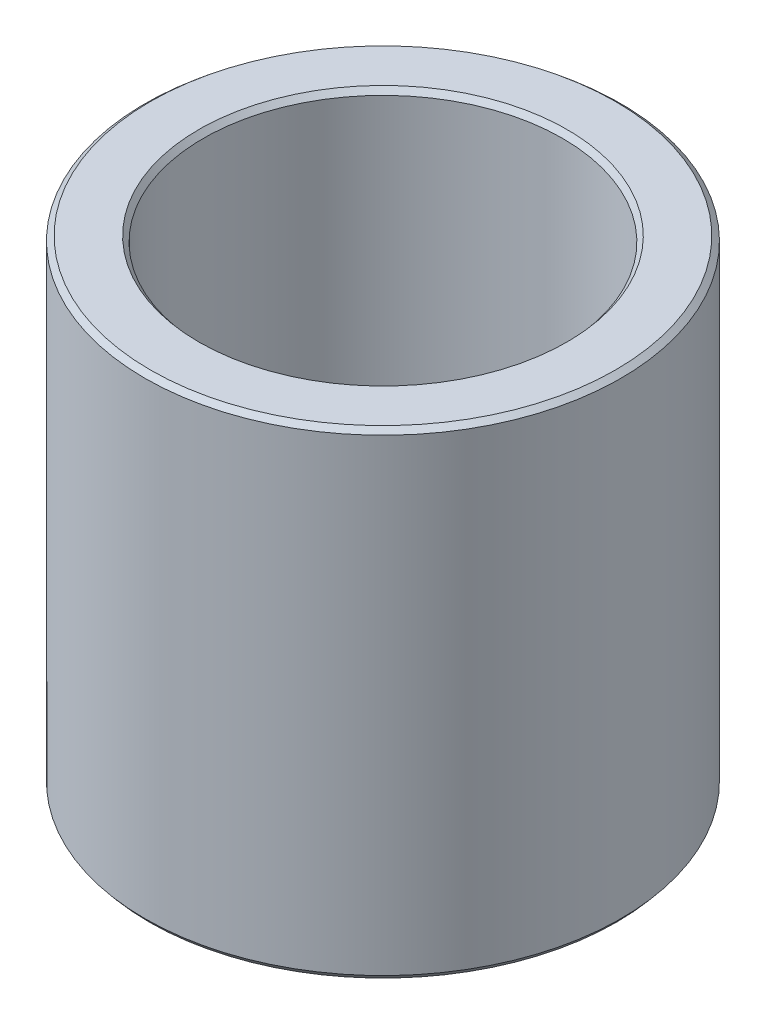
ISO-10303-21;
HEADER;
FILE_DESCRIPTION(('STEP AP214'),'2;1');
FILE_NAME('part.step','',(''),(''),'','','');
FILE_SCHEMA(('AUTOMOTIVE_DESIGN { 1 0 10303 214 1 1 1 1 }'));
ENDSEC;
DATA;
#1=APPLICATION_CONTEXT('core data for automotive mechanical design processes');
#2=APPLICATION_PROTOCOL_DEFINITION('international standard','automotive_design',2000,#1);
#3=PRODUCT_CONTEXT('',#1,'mechanical');
#4=PRODUCT('Part','Part','',(#3));
#5=PRODUCT_RELATED_PRODUCT_CATEGORY('part','',(#4));
#6=PRODUCT_DEFINITION_FORMATION('','',#4);
#7=PRODUCT_DEFINITION_CONTEXT('part definition',#1,'design');
#8=PRODUCT_DEFINITION('design','',#6,#7);
#9=PRODUCT_DEFINITION_SHAPE('','',#8);
#10=(LENGTH_UNIT() NAMED_UNIT(*) SI_UNIT(.MILLI.,.METRE.));
#11=(NAMED_UNIT(*) PLANE_ANGLE_UNIT() SI_UNIT($,.RADIAN.));
#12=(NAMED_UNIT(*) SI_UNIT($,.STERADIAN.) SOLID_ANGLE_UNIT());
#13=UNCERTAINTY_MEASURE_WITH_UNIT(LENGTH_MEASURE(1.E-05),#10,'distance_accuracy_value','');
#14=(GEOMETRIC_REPRESENTATION_CONTEXT(3) GLOBAL_UNCERTAINTY_ASSIGNED_CONTEXT((#13)) GLOBAL_UNIT_ASSIGNED_CONTEXT((#10,
#11,#12)) REPRESENTATION_CONTEXT('',''));
#15=CARTESIAN_POINT('',(0.,0.,0.));
#16=DIRECTION('',(0.,0.,1.));
#17=DIRECTION('',(1.,0.,0.));
#18=AXIS2_PLACEMENT_3D('',#15,#16,#17);
#19=CARTESIAN_POINT('',(0.,55.2294037651439,0.));
#20=DIRECTION('',(0.,-1.,0.));
#21=DIRECTION('',(0.,0.,-1.));
#22=AXIS2_PLACEMENT_3D('',#19,#20,#21);
#23=CYLINDRICAL_SURFACE('',#22,27.5);
#24=CARTESIAN_POINT('',(0.,0.62385524782143,0.));
#25=DIRECTION('',(0.,1.,0.));
#26=DIRECTION('',(0.,0.,1.));
#27=AXIS2_PLACEMENT_3D('',#24,#25,#26);
#28=CIRCLE('',#27,27.5);
#29=CARTESIAN_POINT('',(0.,0.62385524782143,27.5));
#30=VERTEX_POINT('',#29);
#31=EDGE_CURVE('E10',#30,#30,#28,.T.);
#32=ORIENTED_EDGE('',*,*,#31,.T.);
#33=EDGE_LOOP('',(#32));
#34=FACE_BOUND('',#33,.T.);
#35=CARTESIAN_POINT('',(0.,54.7062500959509,0.));
#36=DIRECTION('',(0.,1.,0.));
#37=DIRECTION('',(0.,0.,1.));
#38=AXIS2_PLACEMENT_3D('',#35,#36,#37);
#39=CIRCLE('',#38,27.5);
#40=CARTESIAN_POINT('',(0.,54.7062500959509,27.5));
#41=VERTEX_POINT('',#40);
#42=EDGE_CURVE('E50',#41,#41,#39,.F.);
#43=ORIENTED_EDGE('',*,*,#42,.T.);
#44=EDGE_LOOP('',(#43));
#45=FACE_BOUND('',#44,.T.);
#46=ADVANCED_FACE('F39',(#34,#45),#23,.T.);
#47=CARTESIAN_POINT('',(0.,55.2294037651439,0.));
#48=DIRECTION('',(0.,1.,0.));
#49=DIRECTION('',(0.,0.,1.));
#50=AXIS2_PLACEMENT_3D('',#47,#48,#49);
#51=PLANE('',#50);
#52=CARTESIAN_POINT('',(0.,55.2294037651439,0.));
#53=DIRECTION('',(0.,1.,0.));
#54=DIRECTION('',(0.,0.,1.));
#55=AXIS2_PLACEMENT_3D('',#52,#53,#54);
#56=CIRCLE('',#55,21.2773775607063);
#57=CARTESIAN_POINT('',(0.,55.2294037651439,21.2773775607063));
#58=VERTEX_POINT('',#57);
#59=EDGE_CURVE('E58',#58,#58,#56,.F.);
#60=ORIENTED_EDGE('',*,*,#59,.T.);
#61=EDGE_LOOP('',(#60));
#62=FACE_BOUND('',#61,.T.);
#63=CARTESIAN_POINT('',(0.,55.2294037651439,0.));
#64=DIRECTION('',(0.,1.,0.));
#65=DIRECTION('',(0.,0.,1.));
#66=AXIS2_PLACEMENT_3D('',#63,#64,#65);
#67=CIRCLE('',#66,26.8761447521786);
#68=CARTESIAN_POINT('',(0.,55.2294037651439,26.8761447521786));
#69=VERTEX_POINT('',#68);
#70=EDGE_CURVE('E61',#69,#69,#67,.T.);
#71=ORIENTED_EDGE('',*,*,#70,.T.);
#72=EDGE_LOOP('',(#71));
#73=FACE_BOUND('',#72,.T.);
#74=ADVANCED_FACE('F88',(#62,#73),#51,.T.);
#75=CARTESIAN_POINT('',(0.,0.,0.));
#76=DIRECTION('',(0.,1.,0.));
#77=DIRECTION('',(0.,0.,1.));
#78=AXIS2_PLACEMENT_3D('',#75,#76,#77);
#79=PLANE('',#78);
#80=CARTESIAN_POINT('',(0.,0.,0.));
#81=DIRECTION('',(0.,1.,0.));
#82=DIRECTION('',(0.,0.,1.));
#83=AXIS2_PLACEMENT_3D('',#80,#81,#82);
#84=CIRCLE('',#83,21.3780791393347);
#85=CARTESIAN_POINT('',(0.,0.,21.3780791393347));
#86=VERTEX_POINT('',#85);
#87=EDGE_CURVE('E51',#86,#86,#84,.T.);
#88=ORIENTED_EDGE('',*,*,#87,.T.);
#89=EDGE_LOOP('',(#88));
#90=FACE_BOUND('',#89,.T.);
#91=CARTESIAN_POINT('',(0.,0.,0.));
#92=DIRECTION('',(0.,1.,0.));
#93=DIRECTION('',(0.,0.,1.));
#94=AXIS2_PLACEMENT_3D('',#91,#92,#93);
#95=CIRCLE('',#94,26.976846330807);
#96=CARTESIAN_POINT('',(0.,0.,26.976846330807));
#97=VERTEX_POINT('',#96);
#98=EDGE_CURVE('E54',#97,#97,#95,.F.);
#99=ORIENTED_EDGE('',*,*,#98,.T.);
#100=EDGE_LOOP('',(#99));
#101=FACE_BOUND('',#100,.T.);
#102=ADVANCED_FACE('F83',(#90,#101),#79,.F.);
#103=CARTESIAN_POINT('',(0.,55.2294037651439,0.));
#104=DIRECTION('',(0.,-1.,0.));
#105=DIRECTION('',(0.,0.,-1.));
#106=AXIS2_PLACEMENT_3D('',#103,#104,#105);
#107=CYLINDRICAL_SURFACE('',#106,20.7542238915133);
#108=CARTESIAN_POINT('',(0.,54.6055485173224,0.));
#109=DIRECTION('',(0.,1.,0.));
#110=DIRECTION('',(0.,0.,1.));
#111=AXIS2_PLACEMENT_3D('',#108,#109,#110);
#112=CIRCLE('',#111,20.7542238915133);
#113=CARTESIAN_POINT('',(0.,54.6055485173224,20.7542238915133));
#114=VERTEX_POINT('',#113);
#115=EDGE_CURVE('E67',#114,#114,#112,.T.);
#116=ORIENTED_EDGE('',*,*,#115,.T.);
#117=EDGE_LOOP('',(#116));
#118=FACE_BOUND('',#117,.T.);
#119=CARTESIAN_POINT('',(0.,0.523153669192984,0.));
#120=DIRECTION('',(0.,1.,0.));
#121=DIRECTION('',(0.,0.,1.));
#122=AXIS2_PLACEMENT_3D('',#119,#120,#121);
#123=CIRCLE('',#122,20.7542238915133);
#124=CARTESIAN_POINT('',(0.,0.523153669192984,20.7542238915133));
#125=VERTEX_POINT('',#124);
#126=EDGE_CURVE('E69',#125,#125,#123,.F.);
#127=ORIENTED_EDGE('',*,*,#126,.T.);
#128=EDGE_LOOP('',(#127));
#129=FACE_BOUND('',#128,.T.);
#130=ADVANCED_FACE('F71',(#118,#129),#107,.F.);
#131=CARTESIAN_POINT('',(0.,54.6055485173224,0.));
#132=DIRECTION('',(0.,1.,0.));
#133=DIRECTION('',(0.,0.,1.));
#134=AXIS2_PLACEMENT_3D('',#131,#132,#133);
#135=CONICAL_SURFACE('',#134,20.7542238915133,0.697827759293043);
#136=ORIENTED_EDGE('',*,*,#59,.F.);
#137=EDGE_LOOP('',(#136));
#138=FACE_BOUND('',#137,.T.);
#139=ORIENTED_EDGE('',*,*,#115,.F.);
#140=EDGE_LOOP('',(#139));
#141=FACE_BOUND('',#140,.T.);
#142=ADVANCED_FACE('F77',(#138,#141),#135,.F.);
#143=CARTESIAN_POINT('',(0.,0.,0.));
#144=DIRECTION('',(0.,-1.,0.));
#145=DIRECTION('',(0.,0.,-1.));
#146=AXIS2_PLACEMENT_3D('',#143,#144,#145);
#147=CONICAL_SURFACE('',#146,21.3780791393347,0.872968567501854);
#148=ORIENTED_EDGE('',*,*,#126,.F.);
#149=EDGE_LOOP('',(#148));
#150=FACE_BOUND('',#149,.T.);
#151=ORIENTED_EDGE('',*,*,#87,.F.);
#152=EDGE_LOOP('',(#151));
#153=FACE_BOUND('',#152,.T.);
#154=ADVANCED_FACE('F73',(#150,#153),#147,.F.);
#155=CARTESIAN_POINT('',(0.,0.62385524782143,0.));
#156=DIRECTION('',(0.,1.,0.));
#157=DIRECTION('',(0.,0.,1.));
#158=AXIS2_PLACEMENT_3D('',#155,#156,#157);
#159=CONICAL_SURFACE('',#158,27.5,0.69782775929304);
#160=CARTESIAN_POINT('',(0.,0.,26.976846330807));
#161=CARTESIAN_POINT('',(0.,0.00649849216480645,26.9822958481944));
#162=CARTESIAN_POINT('',(0.,0.012996984329613,26.9877453655819));
#163=CARTESIAN_POINT('',(0.,0.0259939686592261,26.9986444003567));
#164=CARTESIAN_POINT('',(0.,0.0324924608240327,27.0040939177442));
#165=CARTESIAN_POINT('',(0.,0.0454894451536458,27.014992952519));
#166=CARTESIAN_POINT('',(0.,0.0519879373184524,27.0204424699064));
#167=CARTESIAN_POINT('',(0.,0.0649849216480655,27.0313415046813));
#168=CARTESIAN_POINT('',(0.,0.071483413812872,27.0367910220687));
#169=CARTESIAN_POINT('',(0.,0.0844803981424851,27.0476900568436));
#170=CARTESIAN_POINT('',(0.,0.0909788903072917,27.053139574231));
#171=CARTESIAN_POINT('',(0.,0.103975874636905,27.0640386090058));
#172=CARTESIAN_POINT('',(0.,0.110474366801711,27.0694881263933));
#173=CARTESIAN_POINT('',(0.,0.123471351131324,27.0803871611681));
#174=CARTESIAN_POINT('',(0.,0.129969843296131,27.0858366785556));
#175=CARTESIAN_POINT('',(0.,0.142966827625744,27.0967357133304));
#176=CARTESIAN_POINT('',(0.,0.149465319790551,27.1021852307178));
#177=CARTESIAN_POINT('',(0.,0.162462304120164,27.1130842654927));
#178=CARTESIAN_POINT('',(0.,0.16896079628497,27.1185337828801));
#179=CARTESIAN_POINT('',(0.,0.181957780614583,27.129432817655));
#180=CARTESIAN_POINT('',(0.,0.18845627277939,27.1348823350424));
#181=CARTESIAN_POINT('',(0.,0.201453257109003,27.1457813698173));
#182=CARTESIAN_POINT('',(0.,0.20795174927381,27.1512308872047));
#183=CARTESIAN_POINT('',(0.,0.220948733603423,27.1621299219795));
#184=CARTESIAN_POINT('',(0.,0.227447225768229,27.167579439367));
#185=CARTESIAN_POINT('',(0.,0.240444210097843,27.1784784741418));
#186=CARTESIAN_POINT('',(0.,0.246942702262649,27.1839279915292));
#187=CARTESIAN_POINT('',(0.,0.259939686592262,27.1948270263041));
#188=CARTESIAN_POINT('',(0.,0.266438178757069,27.2002765436915));
#189=CARTESIAN_POINT('',(0.,0.279435163086682,27.2111755784664));
#190=CARTESIAN_POINT('',(0.,0.285933655251488,27.2166250958538));
#191=CARTESIAN_POINT('',(0.,0.298930639581102,27.2275241306287));
#192=CARTESIAN_POINT('',(0.,0.305429131745908,27.2329736480161));
#193=CARTESIAN_POINT('',(0.,0.318426116075521,27.2438726827909));
#194=CARTESIAN_POINT('',(0.,0.324924608240328,27.2493222001784));
#195=CARTESIAN_POINT('',(0.,0.337921592569941,27.2602212349532));
#196=CARTESIAN_POINT('',(0.,0.344420084734748,27.2656707523406));
#197=CARTESIAN_POINT('',(0.,0.357417069064361,27.2765697871155));
#198=CARTESIAN_POINT('',(0.,0.363915561229167,27.2820193045029));
#199=CARTESIAN_POINT('',(0.,0.37691254555878,27.2929183392778));
#200=CARTESIAN_POINT('',(0.,0.383411037723587,27.2983678566652));
#201=CARTESIAN_POINT('',(0.,0.3964080220532,27.3092668914401));
#202=CARTESIAN_POINT('',(0.,0.402906514218006,27.3147164088275));
#203=CARTESIAN_POINT('',(0.,0.41590349854762,27.3256154436023));
#204=CARTESIAN_POINT('',(0.,0.422401990712426,27.3310649609898));
#205=CARTESIAN_POINT('',(0.,0.435398975042039,27.3419639957646));
#206=CARTESIAN_POINT('',(0.,0.441897467206846,27.347413513152));
#207=CARTESIAN_POINT('',(0.,0.454894451536459,27.3583125479269));
#208=CARTESIAN_POINT('',(0.,0.461392943701266,27.3637620653143));
#209=CARTESIAN_POINT('',(0.,0.474389928030879,27.3746611000892));
#210=CARTESIAN_POINT('',(0.,0.480888420195685,27.3801106174766));
#211=CARTESIAN_POINT('',(0.,0.493885404525298,27.3910096522515));
#212=CARTESIAN_POINT('',(0.,0.500383896690105,27.3964591696389));
#213=CARTESIAN_POINT('',(0.,0.513380881019718,27.4073582044137));
#214=CARTESIAN_POINT('',(0.,0.519879373184525,27.4128077218012));
#215=CARTESIAN_POINT('',(0.,0.532876357514138,27.423706756576));
#216=CARTESIAN_POINT('',(0.,0.539374849678944,27.4291562739635));
#217=CARTESIAN_POINT('',(0.,0.552371834008557,27.4400553087383));
#218=CARTESIAN_POINT('',(0.,0.558870326173364,27.4455048261257));
#219=CARTESIAN_POINT('',(0.,0.571867310502977,27.4564038609006));
#220=CARTESIAN_POINT('',(0.,0.578365802667784,27.461853378288));
#221=CARTESIAN_POINT('',(0.,0.591362786997397,27.4727524130629));
#222=CARTESIAN_POINT('',(0.,0.597861279162203,27.4782019304503));
#223=CARTESIAN_POINT('',(0.,0.610858263491816,27.4891009652251));
#224=CARTESIAN_POINT('',(0.,0.617356755656623,27.4945504826126));
#225=CARTESIAN_POINT('',(0.,0.62385524782143,27.5));
#226=B_SPLINE_CURVE_WITH_KNOTS('',3,(#160,#161,#162,#163,#164,#165,#166,#167,#168,#169,#170,
#171,#172,#173,#174,#175,#176,#177,#178,#179,#180,#181,#182,#183,#184,#185,#186,#187,#188,#189,
#190,#191,#192,#193,#194,#195,#196,#197,#198,#199,#200,#201,#202,#203,#204,#205,#206,#207,#208,
#209,#210,#211,#212,#213,#214,#215,#216,#217,#218,#219,#220,#221,#222,#223,#224,#225),
.UNSPECIFIED.,.F.,.F.,(4,2,2,2,2,2,2,2,2,2,2,2,2,2,2,2,2,2,2,2,2,2,2,2,2,2,2,2,2,2,2,2,4),(0.,
0.0254430493759549,0.0508860987519097,0.0763291481278646,0.101772197503819,0.127215246879774,
0.152658296255729,0.178101345631684,0.203544395007639,0.228987444383596,0.254430493759551,
0.279873543135506,0.305316592511461,0.330759641887416,0.35620269126337,0.381645740639325,
0.40708879001528,0.432531839391235,0.45797488876719,0.483417938143145,0.5088609875191,
0.534304036895055,0.55974708627101,0.585190135646964,0.610633185022919,0.636076234398877,
0.661519283774831,0.686962333150786,0.712405382526741,0.737848431902696,0.763291481278651,
0.788734530654606,0.814177580030561),.UNSPECIFIED.);
#227=EDGE_CURVE('BSEAM76',#97,#30,#226,.T.);
#228=ORIENTED_EDGE('',*,*,#98,.F.);
#229=ORIENTED_EDGE('',*,*,#31,.F.);
#230=ORIENTED_EDGE('',*,*,#227,.T.);
#231=ORIENTED_EDGE('',*,*,#227,.F.);
#232=EDGE_LOOP('',(#228,#230,#229,#231));
#233=FACE_BOUND('',#232,.T.);
#234=ADVANCED_FACE('F76',(#233),#159,.T.);
#235=CARTESIAN_POINT('',(0.,55.2294037651439,0.));
#236=DIRECTION('',(0.,-1.,0.));
#237=DIRECTION('',(0.,0.,-1.));
#238=AXIS2_PLACEMENT_3D('',#235,#236,#237);
#239=CONICAL_SURFACE('',#238,26.8761447521786,0.872968567501852);
#240=ORIENTED_EDGE('',*,*,#42,.F.);
#241=EDGE_LOOP('',(#240));
#242=FACE_BOUND('',#241,.T.);
#243=ORIENTED_EDGE('',*,*,#70,.F.);
#244=EDGE_LOOP('',(#243));
#245=FACE_BOUND('',#244,.T.);
#246=ADVANCED_FACE('F45',(#242,#245),#239,.T.);
#247=CLOSED_SHELL('',(#46,#74,#102,#130,#142,#154,#234,#246));
#248=MANIFOLD_SOLID_BREP('B2',#247);
#249=ADVANCED_BREP_SHAPE_REPRESENTATION('',(#18,#248),#14);
#250=SHAPE_DEFINITION_REPRESENTATION(#9,#249);
ENDSEC;
END-ISO-10303-21;
